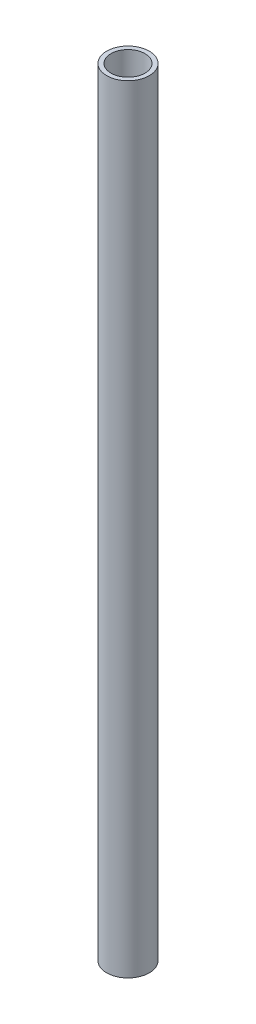
ISO-10303-21;
HEADER;
FILE_DESCRIPTION(('STEP AP214'),'2;1');
FILE_NAME('part.step','',(''),(''),'','','');
FILE_SCHEMA(('AUTOMOTIVE_DESIGN { 1 0 10303 214 1 1 1 1 }'));
ENDSEC;
DATA;
#1=APPLICATION_CONTEXT('core data for automotive mechanical design processes');
#2=APPLICATION_PROTOCOL_DEFINITION('international standard','automotive_design',2000,#1);
#3=PRODUCT_CONTEXT('',#1,'mechanical');
#4=PRODUCT('Part','Part','',(#3));
#5=PRODUCT_RELATED_PRODUCT_CATEGORY('part','',(#4));
#6=PRODUCT_DEFINITION_FORMATION('','',#4);
#7=PRODUCT_DEFINITION_CONTEXT('part definition',#1,'design');
#8=PRODUCT_DEFINITION('design','',#6,#7);
#9=PRODUCT_DEFINITION_SHAPE('','',#8);
#10=(LENGTH_UNIT() NAMED_UNIT(*) SI_UNIT(.MILLI.,.METRE.));
#11=(NAMED_UNIT(*) PLANE_ANGLE_UNIT() SI_UNIT($,.RADIAN.));
#12=(NAMED_UNIT(*) SI_UNIT($,.STERADIAN.) SOLID_ANGLE_UNIT());
#13=UNCERTAINTY_MEASURE_WITH_UNIT(LENGTH_MEASURE(1.E-05),#10,'distance_accuracy_value','');
#14=(GEOMETRIC_REPRESENTATION_CONTEXT(3) GLOBAL_UNCERTAINTY_ASSIGNED_CONTEXT((#13)) GLOBAL_UNIT_ASSIGNED_CONTEXT((#10,
#11,#12)) REPRESENTATION_CONTEXT('',''));
#15=CARTESIAN_POINT('',(0.,0.,0.));
#16=DIRECTION('',(0.,0.,1.));
#17=DIRECTION('',(1.,0.,0.));
#18=AXIS2_PLACEMENT_3D('',#15,#16,#17);
#19=CARTESIAN_POINT('',(0.,609.6,0.));
#20=DIRECTION('',(0.,1.,0.));
#21=DIRECTION('',(0.,0.,1.));
#22=AXIS2_PLACEMENT_3D('',#19,#20,#21);
#23=PLANE('',#22);
#24=CARTESIAN_POINT('',(0.,609.6,0.));
#25=DIRECTION('',(0.,1.,0.));
#26=DIRECTION('',(0.,0.,1.));
#27=AXIS2_PLACEMENT_3D('',#24,#25,#26);
#28=CIRCLE('',#27,16.7005);
#29=CARTESIAN_POINT('',(0.,609.6,16.7005));
#30=VERTEX_POINT('',#29);
#31=EDGE_CURVE('E10',#30,#30,#28,.T.);
#32=ORIENTED_EDGE('',*,*,#31,.T.);
#33=EDGE_LOOP('',(#32));
#34=FACE_BOUND('',#33,.T.);
#35=CARTESIAN_POINT('',(0.,609.6,0.));
#36=DIRECTION('',(0.,1.,0.));
#37=DIRECTION('',(0.,0.,1.));
#38=AXIS2_PLACEMENT_3D('',#35,#36,#37);
#39=CIRCLE('',#38,13.3223);
#40=CARTESIAN_POINT('',(0.,609.6,13.3223));
#41=VERTEX_POINT('',#40);
#42=EDGE_CURVE('E46',#41,#41,#39,.T.);
#43=ORIENTED_EDGE('',*,*,#42,.F.);
#44=EDGE_LOOP('',(#43));
#45=FACE_BOUND('',#44,.T.);
#46=ADVANCED_FACE('F35',(#34,#45),#23,.T.);
#47=CARTESIAN_POINT('',(0.,0.,0.));
#48=DIRECTION('',(0.,1.,0.));
#49=DIRECTION('',(0.,0.,1.));
#50=AXIS2_PLACEMENT_3D('',#47,#48,#49);
#51=PLANE('',#50);
#52=CARTESIAN_POINT('',(0.,0.,0.));
#53=DIRECTION('',(0.,1.,0.));
#54=DIRECTION('',(0.,0.,1.));
#55=AXIS2_PLACEMENT_3D('',#52,#53,#54);
#56=CIRCLE('',#55,16.7005);
#57=CARTESIAN_POINT('',(0.,0.,16.7005));
#58=VERTEX_POINT('',#57);
#59=EDGE_CURVE('E39',#58,#58,#56,.T.);
#60=ORIENTED_EDGE('',*,*,#59,.F.);
#61=EDGE_LOOP('',(#60));
#62=FACE_BOUND('',#61,.T.);
#63=CARTESIAN_POINT('',(0.,0.,0.));
#64=DIRECTION('',(0.,1.,0.));
#65=DIRECTION('',(0.,0.,1.));
#66=AXIS2_PLACEMENT_3D('',#63,#64,#65);
#67=CIRCLE('',#66,13.3223);
#68=CARTESIAN_POINT('',(0.,0.,13.3223));
#69=VERTEX_POINT('',#68);
#70=EDGE_CURVE('E48',#69,#69,#67,.T.);
#71=ORIENTED_EDGE('',*,*,#70,.T.);
#72=EDGE_LOOP('',(#71));
#73=FACE_BOUND('',#72,.T.);
#74=ADVANCED_FACE('F58',(#62,#73),#51,.F.);
#75=CARTESIAN_POINT('',(0.,609.6,0.));
#76=DIRECTION('',(0.,-1.,0.));
#77=DIRECTION('',(0.,0.,-1.));
#78=AXIS2_PLACEMENT_3D('',#75,#76,#77);
#79=CYLINDRICAL_SURFACE('',#78,16.7005);
#80=ORIENTED_EDGE('',*,*,#31,.F.);
#81=EDGE_LOOP('',(#80));
#82=FACE_BOUND('',#81,.T.);
#83=ORIENTED_EDGE('',*,*,#59,.T.);
#84=EDGE_LOOP('',(#83));
#85=FACE_BOUND('',#84,.T.);
#86=ADVANCED_FACE('F37',(#82,#85),#79,.T.);
#87=CARTESIAN_POINT('',(0.,609.6,0.));
#88=DIRECTION('',(0.,-1.,0.));
#89=DIRECTION('',(0.,0.,-1.));
#90=AXIS2_PLACEMENT_3D('',#87,#88,#89);
#91=CYLINDRICAL_SURFACE('',#90,13.3223);
#92=ORIENTED_EDGE('',*,*,#42,.T.);
#93=EDGE_LOOP('',(#92));
#94=FACE_BOUND('',#93,.T.);
#95=ORIENTED_EDGE('',*,*,#70,.F.);
#96=EDGE_LOOP('',(#95));
#97=FACE_BOUND('',#96,.T.);
#98=ADVANCED_FACE('F54',(#94,#97),#91,.F.);
#99=CLOSED_SHELL('',(#46,#74,#86,#98));
#100=MANIFOLD_SOLID_BREP('B2',#99);
#101=ADVANCED_BREP_SHAPE_REPRESENTATION('',(#18,#100),#14);
#102=SHAPE_DEFINITION_REPRESENTATION(#9,#101);
ENDSEC;
END-ISO-10303-21;
